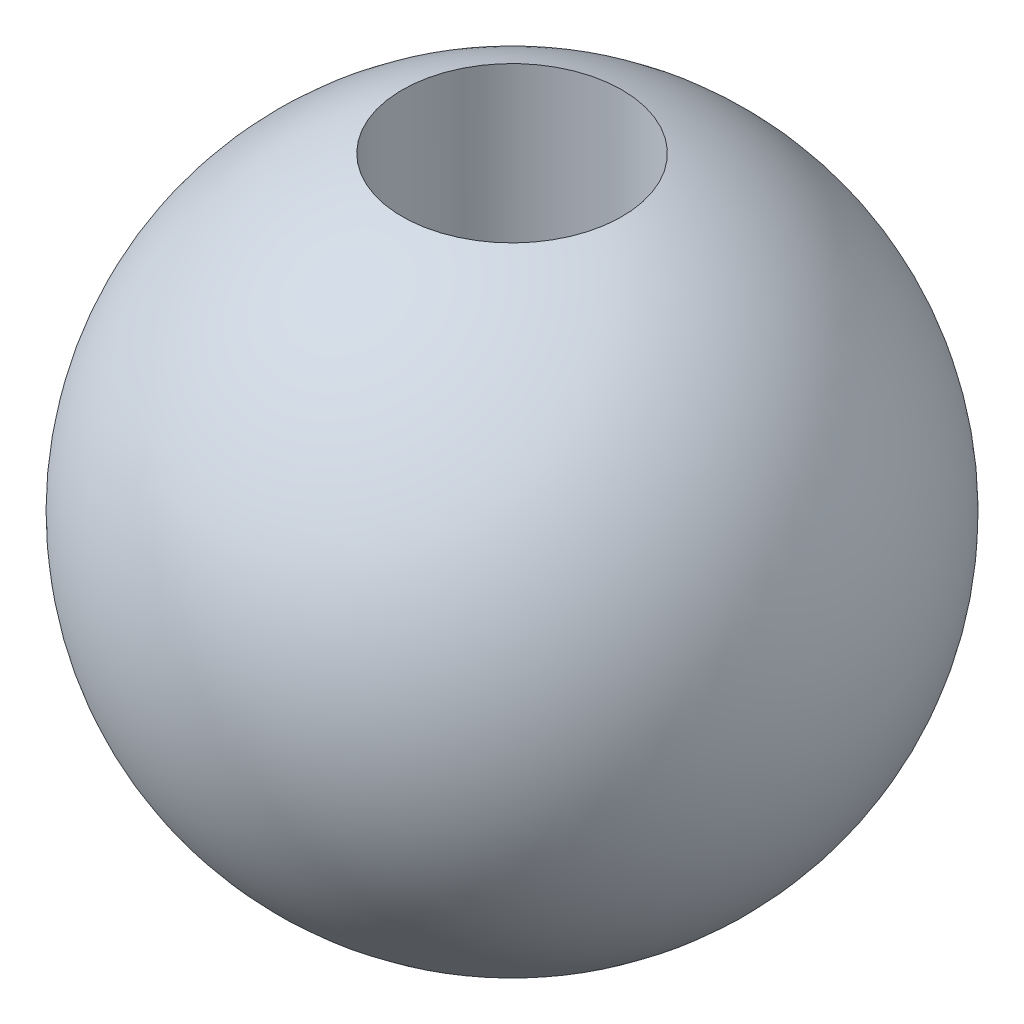
ISO-10303-21;
HEADER;
FILE_DESCRIPTION(('STEP AP214'),'2;1');
FILE_NAME('part.step','',(''),(''),'','','');
FILE_SCHEMA(('AUTOMOTIVE_DESIGN { 1 0 10303 214 1 1 1 1 }'));
ENDSEC;
DATA;
#1=APPLICATION_CONTEXT('core data for automotive mechanical design processes');
#2=APPLICATION_PROTOCOL_DEFINITION('international standard','automotive_design',2000,#1);
#3=PRODUCT_CONTEXT('',#1,'mechanical');
#4=PRODUCT('Part','Part','',(#3));
#5=PRODUCT_RELATED_PRODUCT_CATEGORY('part','',(#4));
#6=PRODUCT_DEFINITION_FORMATION('','',#4);
#7=PRODUCT_DEFINITION_CONTEXT('part definition',#1,'design');
#8=PRODUCT_DEFINITION('design','',#6,#7);
#9=PRODUCT_DEFINITION_SHAPE('','',#8);
#10=(LENGTH_UNIT() NAMED_UNIT(*) SI_UNIT(.MILLI.,.METRE.));
#11=(NAMED_UNIT(*) PLANE_ANGLE_UNIT() SI_UNIT($,.RADIAN.));
#12=(NAMED_UNIT(*) SI_UNIT($,.STERADIAN.) SOLID_ANGLE_UNIT());
#13=UNCERTAINTY_MEASURE_WITH_UNIT(LENGTH_MEASURE(1.E-05),#10,'distance_accuracy_value','');
#14=(GEOMETRIC_REPRESENTATION_CONTEXT(3) GLOBAL_UNCERTAINTY_ASSIGNED_CONTEXT((#13)) GLOBAL_UNIT_ASSIGNED_CONTEXT((#10,
#11,#12)) REPRESENTATION_CONTEXT('',''));
#15=CARTESIAN_POINT('',(0.,0.,0.));
#16=DIRECTION('',(0.,0.,1.));
#17=DIRECTION('',(1.,0.,0.));
#18=AXIS2_PLACEMENT_3D('',#15,#16,#17);
#19=CARTESIAN_POINT('',(0.,0.,0.));
#20=DIRECTION('',(0.,1.,0.));
#21=DIRECTION('',(0.,0.,-1.));
#22=AXIS2_PLACEMENT_3D('',#19,#20,#21);
#23=SPHERICAL_SURFACE('',#22,3.);
#24=CARTESIAN_POINT('',(0.,2.82842712474619,0.));
#25=DIRECTION('',(0.,-1.,0.));
#26=DIRECTION('',(0.,0.,-1.));
#27=AXIS2_PLACEMENT_3D('',#24,#25,#26);
#28=CIRCLE('',#27,1.);
#29=CARTESIAN_POINT('',(0.,2.82842712474619,-1.));
#30=VERTEX_POINT('',#29);
#31=EDGE_CURVE('E10',#30,#30,#28,.T.);
#32=ORIENTED_EDGE('',*,*,#31,.T.);
#33=EDGE_LOOP('',(#32));
#34=FACE_BOUND('',#33,.T.);
#35=CARTESIAN_POINT('',(0.,-2.82842712474619,0.));
#36=DIRECTION('',(0.,1.,0.));
#37=DIRECTION('',(0.,0.,1.));
#38=AXIS2_PLACEMENT_3D('',#35,#36,#37);
#39=CIRCLE('',#38,1.);
#40=CARTESIAN_POINT('',(0.,-2.82842712474619,1.));
#41=VERTEX_POINT('',#40);
#42=EDGE_CURVE('E45',#41,#41,#39,.T.);
#43=ORIENTED_EDGE('',*,*,#42,.T.);
#44=EDGE_LOOP('',(#43));
#45=FACE_BOUND('',#44,.T.);
#46=ADVANCED_FACE('F39',(#34,#45),#23,.T.);
#47=CARTESIAN_POINT('',(0.,-3.,0.));
#48=DIRECTION('',(0.,1.,0.));
#49=DIRECTION('',(0.,0.,1.));
#50=AXIS2_PLACEMENT_3D('',#47,#48,#49);
#51=CYLINDRICAL_SURFACE('',#50,1.);
#52=ORIENTED_EDGE('',*,*,#42,.F.);
#53=EDGE_LOOP('',(#52));
#54=FACE_BOUND('',#53,.T.);
#55=ORIENTED_EDGE('',*,*,#31,.F.);
#56=EDGE_LOOP('',(#55));
#57=FACE_BOUND('',#56,.T.);
#58=ADVANCED_FACE('F52',(#54,#57),#51,.F.);
#59=CLOSED_SHELL('',(#46,#58));
#60=MANIFOLD_SOLID_BREP('B2',#59);
#61=ADVANCED_BREP_SHAPE_REPRESENTATION('',(#18,#60),#14);
#62=SHAPE_DEFINITION_REPRESENTATION(#9,#61);
ENDSEC;
END-ISO-10303-21;
